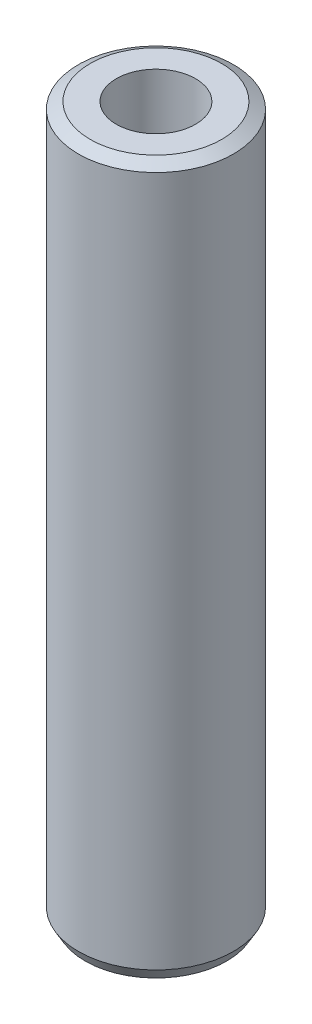
ISO-10303-21;
HEADER;
FILE_DESCRIPTION(('STEP AP214'),'2;1');
FILE_NAME('part.step','',(''),(''),'','','');
FILE_SCHEMA(('AUTOMOTIVE_DESIGN { 1 0 10303 214 1 1 1 1 }'));
ENDSEC;
DATA;
#1=APPLICATION_CONTEXT('core data for automotive mechanical design processes');
#2=APPLICATION_PROTOCOL_DEFINITION('international standard','automotive_design',2000,#1);
#3=PRODUCT_CONTEXT('',#1,'mechanical');
#4=PRODUCT('Part','Part','',(#3));
#5=PRODUCT_RELATED_PRODUCT_CATEGORY('part','',(#4));
#6=PRODUCT_DEFINITION_FORMATION('','',#4);
#7=PRODUCT_DEFINITION_CONTEXT('part definition',#1,'design');
#8=PRODUCT_DEFINITION('design','',#6,#7);
#9=PRODUCT_DEFINITION_SHAPE('','',#8);
#10=(LENGTH_UNIT() NAMED_UNIT(*) SI_UNIT(.MILLI.,.METRE.));
#11=(NAMED_UNIT(*) PLANE_ANGLE_UNIT() SI_UNIT($,.RADIAN.));
#12=(NAMED_UNIT(*) SI_UNIT($,.STERADIAN.) SOLID_ANGLE_UNIT());
#13=UNCERTAINTY_MEASURE_WITH_UNIT(LENGTH_MEASURE(1.E-05),#10,'distance_accuracy_value','');
#14=(GEOMETRIC_REPRESENTATION_CONTEXT(3) GLOBAL_UNCERTAINTY_ASSIGNED_CONTEXT((#13)) GLOBAL_UNIT_ASSIGNED_CONTEXT((#10,
#11,#12)) REPRESENTATION_CONTEXT('',''));
#15=CARTESIAN_POINT('',(0.,0.,0.));
#16=DIRECTION('',(0.,0.,1.));
#17=DIRECTION('',(1.,0.,0.));
#18=AXIS2_PLACEMENT_3D('',#15,#16,#17);
#19=CARTESIAN_POINT('',(0.,68.5967527735033,0.));
#20=DIRECTION('',(0.,-1.,0.));
#21=DIRECTION('',(0.,0.,-1.));
#22=AXIS2_PLACEMENT_3D('',#19,#20,#21);
#23=CYLINDRICAL_SURFACE('',#22,7.5);
#24=CARTESIAN_POINT('',(0.,67.9402456215174,0.));
#25=DIRECTION('',(0.,1.,0.));
#26=DIRECTION('',(0.,0.,1.));
#27=AXIS2_PLACEMENT_3D('',#24,#25,#26);
#28=CIRCLE('',#27,7.5);
#29=CARTESIAN_POINT('',(0.,67.9402456215174,7.5));
#30=VERTEX_POINT('',#29);
#31=EDGE_CURVE('E50',#30,#30,#28,.F.);
#32=ORIENTED_EDGE('',*,*,#31,.T.);
#33=EDGE_LOOP('',(#32));
#34=FACE_BOUND('',#33,.T.);
#35=CARTESIAN_POINT('',(0.,1.13710374277183,0.));
#36=DIRECTION('',(0.,1.,0.));
#37=DIRECTION('',(0.,0.,1.));
#38=AXIS2_PLACEMENT_3D('',#35,#36,#37);
#39=CIRCLE('',#38,7.5);
#40=CARTESIAN_POINT('',(0.,1.13710374277183,7.5));
#41=VERTEX_POINT('',#40);
#42=EDGE_CURVE('E51',#41,#41,#39,.T.);
#43=ORIENTED_EDGE('',*,*,#42,.T.);
#44=EDGE_LOOP('',(#43));
#45=FACE_BOUND('',#44,.T.);
#46=ADVANCED_FACE('F39',(#34,#45),#23,.T.);
#47=CARTESIAN_POINT('',(0.,68.5967527735033,0.));
#48=DIRECTION('',(0.,1.,0.));
#49=DIRECTION('',(0.,0.,1.));
#50=AXIS2_PLACEMENT_3D('',#47,#48,#49);
#51=PLANE('',#50);
#52=CARTESIAN_POINT('',(0.,68.5967527735033,0.));
#53=DIRECTION('',(0.,1.,0.));
#54=DIRECTION('',(0.,0.,1.));
#55=AXIS2_PLACEMENT_3D('',#52,#53,#54);
#56=CIRCLE('',#55,6.36289625722815);
#57=CARTESIAN_POINT('',(0.,68.5967527735033,6.36289625722815));
#58=VERTEX_POINT('',#57);
#59=EDGE_CURVE('E54',#58,#58,#56,.T.);
#60=ORIENTED_EDGE('',*,*,#59,.T.);
#61=EDGE_LOOP('',(#60));
#62=FACE_BOUND('',#61,.T.);
#63=CARTESIAN_POINT('',(0.,68.5967527735033,0.));
#64=DIRECTION('',(0.,1.,0.));
#65=DIRECTION('',(0.,0.,1.));
#66=AXIS2_PLACEMENT_3D('',#63,#64,#65);
#67=CIRCLE('',#66,3.8294214990563);
#68=CARTESIAN_POINT('',(0.,68.5967527735033,3.8294214990563));
#69=VERTEX_POINT('',#68);
#70=EDGE_CURVE('E58',#69,#69,#67,.T.);
#71=ORIENTED_EDGE('',*,*,#70,.F.);
#72=EDGE_LOOP('',(#71));
#73=FACE_BOUND('',#72,.T.);
#74=ADVANCED_FACE('F69',(#62,#73),#51,.T.);
#75=CARTESIAN_POINT('',(0.,0.,0.));
#76=DIRECTION('',(0.,1.,0.));
#77=DIRECTION('',(0.,0.,1.));
#78=AXIS2_PLACEMENT_3D('',#75,#76,#77);
#79=PLANE('',#78);
#80=CARTESIAN_POINT('',(0.,0.,0.));
#81=DIRECTION('',(0.,1.,0.));
#82=DIRECTION('',(0.,0.,1.));
#83=AXIS2_PLACEMENT_3D('',#80,#81,#82);
#84=CIRCLE('',#83,6.84349284801414);
#85=CARTESIAN_POINT('',(0.,0.,6.84349284801414));
#86=VERTEX_POINT('',#85);
#87=EDGE_CURVE('E10',#86,#86,#84,.F.);
#88=ORIENTED_EDGE('',*,*,#87,.T.);
#89=EDGE_LOOP('',(#88));
#90=FACE_BOUND('',#89,.T.);
#91=CARTESIAN_POINT('',(0.,0.,0.));
#92=DIRECTION('',(0.,1.,0.));
#93=DIRECTION('',(0.,0.,1.));
#94=AXIS2_PLACEMENT_3D('',#91,#92,#93);
#95=CIRCLE('',#94,3.8294214990563);
#96=CARTESIAN_POINT('',(0.,0.,3.8294214990563));
#97=VERTEX_POINT('',#96);
#98=EDGE_CURVE('E63',#97,#97,#95,.T.);
#99=ORIENTED_EDGE('',*,*,#98,.T.);
#100=EDGE_LOOP('',(#99));
#101=FACE_BOUND('',#100,.T.);
#102=ADVANCED_FACE('F75',(#90,#101),#79,.F.);
#103=CARTESIAN_POINT('',(0.,68.5967527735033,0.));
#104=DIRECTION('',(0.,-1.,0.));
#105=DIRECTION('',(0.,0.,-1.));
#106=AXIS2_PLACEMENT_3D('',#103,#104,#105);
#107=CYLINDRICAL_SURFACE('',#106,3.8294214990563);
#108=ORIENTED_EDGE('',*,*,#70,.T.);
#109=EDGE_LOOP('',(#108));
#110=FACE_BOUND('',#109,.T.);
#111=ORIENTED_EDGE('',*,*,#98,.F.);
#112=EDGE_LOOP('',(#111));
#113=FACE_BOUND('',#112,.T.);
#114=ADVANCED_FACE('F70',(#110,#113),#107,.F.);
#115=CARTESIAN_POINT('',(0.,68.5967527735033,0.));
#116=DIRECTION('',(0.,-1.,0.));
#117=DIRECTION('',(0.,0.,-1.));
#118=AXIS2_PLACEMENT_3D('',#115,#116,#117);
#119=CONICAL_SURFACE('',#118,6.36289625722815,1.0471975511966);
#120=ORIENTED_EDGE('',*,*,#31,.F.);
#121=EDGE_LOOP('',(#120));
#122=FACE_BOUND('',#121,.T.);
#123=ORIENTED_EDGE('',*,*,#59,.F.);
#124=EDGE_LOOP('',(#123));
#125=FACE_BOUND('',#124,.T.);
#126=ADVANCED_FACE('F81',(#122,#125),#119,.T.);
#127=CARTESIAN_POINT('',(0.,1.13710374277183,0.));
#128=DIRECTION('',(0.,1.,0.));
#129=DIRECTION('',(0.,0.,1.));
#130=AXIS2_PLACEMENT_3D('',#127,#128,#129);
#131=CONICAL_SURFACE('',#130,7.5,0.523598775598304);
#132=ORIENTED_EDGE('',*,*,#87,.F.);
#133=EDGE_LOOP('',(#132));
#134=FACE_BOUND('',#133,.T.);
#135=ORIENTED_EDGE('',*,*,#42,.F.);
#136=EDGE_LOOP('',(#135));
#137=FACE_BOUND('',#136,.T.);
#138=ADVANCED_FACE('F45',(#134,#137),#131,.T.);
#139=CLOSED_SHELL('',(#46,#74,#102,#114,#126,#138));
#140=MANIFOLD_SOLID_BREP('B2',#139);
#141=ADVANCED_BREP_SHAPE_REPRESENTATION('',(#18,#140),#14);
#142=SHAPE_DEFINITION_REPRESENTATION(#9,#141);
ENDSEC;
END-ISO-10303-21;
